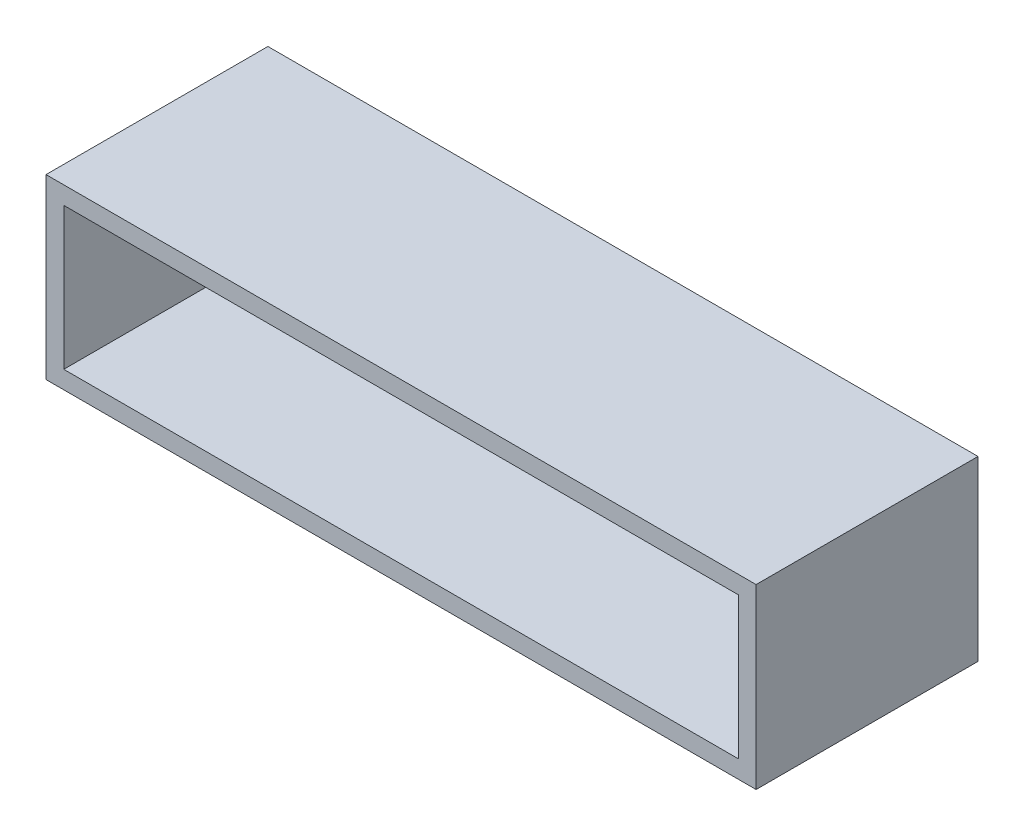
ISO-10303-21;
HEADER;
FILE_DESCRIPTION(('STEP AP214'),'2;1');
FILE_NAME('part.step','',(''),(''),'','','');
FILE_SCHEMA(('AUTOMOTIVE_DESIGN { 1 0 10303 214 1 1 1 1 }'));
ENDSEC;
DATA;
#1=APPLICATION_CONTEXT('core data for automotive mechanical design processes');
#2=APPLICATION_PROTOCOL_DEFINITION('international standard','automotive_design',2000,#1);
#3=PRODUCT_CONTEXT('',#1,'mechanical');
#4=PRODUCT('Part','Part','',(#3));
#5=PRODUCT_RELATED_PRODUCT_CATEGORY('part','',(#4));
#6=PRODUCT_DEFINITION_FORMATION('','',#4);
#7=PRODUCT_DEFINITION_CONTEXT('part definition',#1,'design');
#8=PRODUCT_DEFINITION('design','',#6,#7);
#9=PRODUCT_DEFINITION_SHAPE('','',#8);
#10=(LENGTH_UNIT() NAMED_UNIT(*) SI_UNIT(.MILLI.,.METRE.));
#11=(NAMED_UNIT(*) PLANE_ANGLE_UNIT() SI_UNIT($,.RADIAN.));
#12=(NAMED_UNIT(*) SI_UNIT($,.STERADIAN.) SOLID_ANGLE_UNIT());
#13=UNCERTAINTY_MEASURE_WITH_UNIT(LENGTH_MEASURE(1.E-05),#10,'distance_accuracy_value','');
#14=(GEOMETRIC_REPRESENTATION_CONTEXT(3) GLOBAL_UNCERTAINTY_ASSIGNED_CONTEXT((#13)) GLOBAL_UNIT_ASSIGNED_CONTEXT((#10,
#11,#12)) REPRESENTATION_CONTEXT('',''));
#15=CARTESIAN_POINT('',(0.,0.,0.));
#16=DIRECTION('',(0.,0.,1.));
#17=DIRECTION('',(1.,0.,0.));
#18=AXIS2_PLACEMENT_3D('',#15,#16,#17);
#19=CARTESIAN_POINT('',(-44.1965984572754,20.,30.0782406167568));
#20=DIRECTION('',(1.,0.,0.));
#21=DIRECTION('',(0.,0.,-1.));
#22=AXIS2_PLACEMENT_3D('',#19,#20,#21);
#23=PLANE('',#22);
#24=DIRECTION('',(0.,0.,1.));
#25=VECTOR('',#24,1.);
#26=CARTESIAN_POINT('',(-44.1965984572754,0.,30.0782406167568));
#27=LINE('',#26,#25);
#28=CARTESIAN_POINT('',(-44.1965984572754,0.,5.07824061675684));
#29=VERTEX_POINT('',#28);
#30=CARTESIAN_POINT('',(-44.1965984572754,0.,30.0782406167568));
#31=VERTEX_POINT('',#30);
#32=EDGE_CURVE('E144',#29,#31,#27,.T.);
#33=ORIENTED_EDGE('',*,*,#32,.T.);
#34=DIRECTION('',(0.,-1.,0.));
#35=VECTOR('',#34,1.);
#36=CARTESIAN_POINT('',(-44.1965984572754,20.,30.0782406167568));
#37=LINE('',#36,#35);
#38=CARTESIAN_POINT('',(-44.1965984572754,20.,30.0782406167568));
#39=VERTEX_POINT('',#38);
#40=EDGE_CURVE('E11',#39,#31,#37,.T.);
#41=ORIENTED_EDGE('',*,*,#40,.F.);
#42=DIRECTION('',(0.,0.,1.));
#43=VECTOR('',#42,1.);
#44=CARTESIAN_POINT('',(-44.1965984572754,20.,30.0782406167568));
#45=LINE('',#44,#43);
#46=CARTESIAN_POINT('',(-44.1965984572754,20.,5.07824061675684));
#47=VERTEX_POINT('',#46);
#48=EDGE_CURVE('E148',#47,#39,#45,.T.);
#49=ORIENTED_EDGE('',*,*,#48,.F.);
#50=DIRECTION('',(0.,-1.,0.));
#51=VECTOR('',#50,1.);
#52=CARTESIAN_POINT('',(-44.1965984572754,20.,5.07824061675684));
#53=LINE('',#52,#51);
#54=EDGE_CURVE('E154',#47,#29,#53,.T.);
#55=ORIENTED_EDGE('',*,*,#54,.T.);
#56=EDGE_LOOP('',(#33,#41,#49,#55));
#57=FACE_BOUND('',#56,.T.);
#58=ADVANCED_FACE('F33',(#57),#23,.F.);
#59=CARTESIAN_POINT('',(-44.1965984572754,20.,30.0782406167568));
#60=DIRECTION('',(0.,0.,-1.));
#61=DIRECTION('',(-1.,0.,0.));
#62=AXIS2_PLACEMENT_3D('',#59,#60,#61);
#63=PLANE('',#62);
#64=DIRECTION('',(1.,0.,0.));
#65=VECTOR('',#64,1.);
#66=CARTESIAN_POINT('',(-42.1965984572754,2.,30.0782406167568));
#67=LINE('',#66,#65);
#68=CARTESIAN_POINT('',(-42.1965984572754,2.,30.0782406167568));
#69=VERTEX_POINT('',#68);
#70=CARTESIAN_POINT('',(33.8034015427246,2.,30.0782406167568));
#71=VERTEX_POINT('',#70);
#72=EDGE_CURVE('E138',#69,#71,#67,.T.);
#73=ORIENTED_EDGE('',*,*,#72,.F.);
#74=DIRECTION('',(0.,-1.,0.));
#75=VECTOR('',#74,1.);
#76=CARTESIAN_POINT('',(-42.1965984572754,18.,30.0782406167568));
#77=LINE('',#76,#75);
#78=CARTESIAN_POINT('',(-42.1965984572754,18.,30.0782406167568));
#79=VERTEX_POINT('',#78);
#80=EDGE_CURVE('E47',#79,#69,#77,.T.);
#81=ORIENTED_EDGE('',*,*,#80,.F.);
#82=DIRECTION('',(-1.,0.,0.));
#83=VECTOR('',#82,1.);
#84=CARTESIAN_POINT('',(-42.1965984572754,18.,30.0782406167568));
#85=LINE('',#84,#83);
#86=CARTESIAN_POINT('',(33.8034015427246,18.,30.0782406167568));
#87=VERTEX_POINT('',#86);
#88=EDGE_CURVE('E126',#87,#79,#85,.T.);
#89=ORIENTED_EDGE('',*,*,#88,.F.);
#90=DIRECTION('',(0.,1.,0.));
#91=VECTOR('',#90,1.);
#92=CARTESIAN_POINT('',(33.8034015427246,18.,30.0782406167568));
#93=LINE('',#92,#91);
#94=EDGE_CURVE('E129',#71,#87,#93,.T.);
#95=ORIENTED_EDGE('',*,*,#94,.F.);
#96=EDGE_LOOP('',(#73,#81,#89,#95));
#97=FACE_BOUND('',#96,.T.);
#98=DIRECTION('',(1.,0.,0.));
#99=VECTOR('',#98,1.);
#100=CARTESIAN_POINT('',(-44.1965984572754,0.,30.0782406167568));
#101=LINE('',#100,#99);
#102=CARTESIAN_POINT('',(35.8034015427246,0.,30.0782406167568));
#103=VERTEX_POINT('',#102);
#104=EDGE_CURVE('E157',#31,#103,#101,.T.);
#105=ORIENTED_EDGE('',*,*,#104,.T.);
#106=DIRECTION('',(0.,-1.,0.));
#107=VECTOR('',#106,1.);
#108=CARTESIAN_POINT('',(35.8034015427246,20.,30.0782406167568));
#109=LINE('',#108,#107);
#110=CARTESIAN_POINT('',(35.8034015427246,20.,30.0782406167568));
#111=VERTEX_POINT('',#110);
#112=EDGE_CURVE('E40',#111,#103,#109,.T.);
#113=ORIENTED_EDGE('',*,*,#112,.F.);
#114=DIRECTION('',(1.,0.,0.));
#115=VECTOR('',#114,1.);
#116=CARTESIAN_POINT('',(-44.1965984572754,20.,30.0782406167568));
#117=LINE('',#116,#115);
#118=EDGE_CURVE('E84',#39,#111,#117,.T.);
#119=ORIENTED_EDGE('',*,*,#118,.F.);
#120=ORIENTED_EDGE('',*,*,#40,.T.);
#121=EDGE_LOOP('',(#105,#113,#119,#120));
#122=FACE_BOUND('',#121,.T.);
#123=ADVANCED_FACE('F188',(#97,#122),#63,.F.);
#124=CARTESIAN_POINT('',(35.8034015427246,20.,30.0782406167568));
#125=DIRECTION('',(-1.,0.,0.));
#126=DIRECTION('',(0.,0.,1.));
#127=AXIS2_PLACEMENT_3D('',#124,#125,#126);
#128=PLANE('',#127);
#129=DIRECTION('',(0.,0.,-1.));
#130=VECTOR('',#129,1.);
#131=CARTESIAN_POINT('',(35.8034015427246,0.,30.0782406167568));
#132=LINE('',#131,#130);
#133=CARTESIAN_POINT('',(35.8034015427246,0.,5.07824061675684));
#134=VERTEX_POINT('',#133);
#135=EDGE_CURVE('E159',#103,#134,#132,.T.);
#136=ORIENTED_EDGE('',*,*,#135,.T.);
#137=DIRECTION('',(0.,-1.,0.));
#138=VECTOR('',#137,1.);
#139=CARTESIAN_POINT('',(35.8034015427246,20.,5.07824061675684));
#140=LINE('',#139,#138);
#141=CARTESIAN_POINT('',(35.8034015427246,20.,5.07824061675684));
#142=VERTEX_POINT('',#141);
#143=EDGE_CURVE('E163',#142,#134,#140,.T.);
#144=ORIENTED_EDGE('',*,*,#143,.F.);
#145=DIRECTION('',(0.,0.,-1.));
#146=VECTOR('',#145,1.);
#147=CARTESIAN_POINT('',(35.8034015427246,20.,30.0782406167568));
#148=LINE('',#147,#146);
#149=EDGE_CURVE('E151',#111,#142,#148,.T.);
#150=ORIENTED_EDGE('',*,*,#149,.F.);
#151=ORIENTED_EDGE('',*,*,#112,.T.);
#152=EDGE_LOOP('',(#136,#144,#150,#151));
#153=FACE_BOUND('',#152,.T.);
#154=ADVANCED_FACE('F168',(#153),#128,.F.);
#155=CARTESIAN_POINT('',(-44.1965984572754,20.,5.07824061675684));
#156=DIRECTION('',(0.,0.,1.));
#157=DIRECTION('',(1.,0.,0.));
#158=AXIS2_PLACEMENT_3D('',#155,#156,#157);
#159=PLANE('',#158);
#160=CARTESIAN_POINT('',(23.3034015427246,10.,5.07824061675684));
#161=DIRECTION('',(0.,0.,1.));
#162=DIRECTION('',(1.,0.,0.));
#163=AXIS2_PLACEMENT_3D('',#160,#161,#162);
#164=CIRCLE('',#163,2.5);
#165=CARTESIAN_POINT('',(25.8034015427246,10.,5.07824061675684));
#166=VERTEX_POINT('',#165);
#167=EDGE_CURVE('E294',#166,#166,#164,.T.);
#168=ORIENTED_EDGE('',*,*,#167,.T.);
#169=EDGE_LOOP('',(#168));
#170=FACE_BOUND('',#169,.T.);
#171=CARTESIAN_POINT('',(-31.6965984572754,9.99999999999999,5.07824061675684));
#172=DIRECTION('',(0.,0.,1.));
#173=DIRECTION('',(1.,0.,0.));
#174=AXIS2_PLACEMENT_3D('',#171,#172,#173);
#175=CIRCLE('',#174,2.5);
#176=CARTESIAN_POINT('',(-29.1965984572754,9.99999999999999,5.07824061675684));
#177=VERTEX_POINT('',#176);
#178=EDGE_CURVE('E298',#177,#177,#175,.T.);
#179=ORIENTED_EDGE('',*,*,#178,.T.);
#180=EDGE_LOOP('',(#179));
#181=FACE_BOUND('',#180,.T.);
#182=CARTESIAN_POINT('',(-39.1965984572754,10.,5.07824061675684));
#183=DIRECTION('',(0.,0.,1.));
#184=DIRECTION('',(1.,0.,0.));
#185=AXIS2_PLACEMENT_3D('',#182,#183,#184);
#186=CIRCLE('',#185,0.999999999999998);
#187=CARTESIAN_POINT('',(-38.1965984572754,10.,5.07824061675684));
#188=VERTEX_POINT('',#187);
#189=EDGE_CURVE('E307',#188,#188,#186,.T.);
#190=ORIENTED_EDGE('',*,*,#189,.T.);
#191=EDGE_LOOP('',(#190));
#192=FACE_BOUND('',#191,.T.);
#193=CARTESIAN_POINT('',(30.8034015427246,10.,5.07824061675684));
#194=DIRECTION('',(0.,0.,1.));
#195=DIRECTION('',(1.,0.,0.));
#196=AXIS2_PLACEMENT_3D('',#193,#194,#195);
#197=CIRCLE('',#196,0.999999999999994);
#198=CARTESIAN_POINT('',(31.8034015427246,10.,5.07824061675684));
#199=VERTEX_POINT('',#198);
#200=EDGE_CURVE('E132',#199,#199,#197,.T.);
#201=ORIENTED_EDGE('',*,*,#200,.T.);
#202=EDGE_LOOP('',(#201));
#203=FACE_BOUND('',#202,.T.);
#204=DIRECTION('',(-1.,0.,0.));
#205=VECTOR('',#204,1.);
#206=CARTESIAN_POINT('',(-44.1965984572754,0.,5.07824061675684));
#207=LINE('',#206,#205);
#208=EDGE_CURVE('E77',#134,#29,#207,.T.);
#209=ORIENTED_EDGE('',*,*,#208,.T.);
#210=ORIENTED_EDGE('',*,*,#54,.F.);
#211=DIRECTION('',(-1.,0.,0.));
#212=VECTOR('',#211,1.);
#213=CARTESIAN_POINT('',(-44.1965984572754,20.,5.07824061675684));
#214=LINE('',#213,#212);
#215=EDGE_CURVE('E56',#142,#47,#214,.T.);
#216=ORIENTED_EDGE('',*,*,#215,.F.);
#217=ORIENTED_EDGE('',*,*,#143,.T.);
#218=EDGE_LOOP('',(#209,#210,#216,#217));
#219=FACE_BOUND('',#218,.T.);
#220=ADVANCED_FACE('F176',(#170,#181,#192,#203,#219),#159,.F.);
#221=CARTESIAN_POINT('',(0.,20.,0.));
#222=DIRECTION('',(0.,-1.,0.));
#223=DIRECTION('',(0.,0.,-1.));
#224=AXIS2_PLACEMENT_3D('',#221,#222,#223);
#225=PLANE('',#224);
#226=ORIENTED_EDGE('',*,*,#48,.T.);
#227=ORIENTED_EDGE('',*,*,#118,.T.);
#228=ORIENTED_EDGE('',*,*,#149,.T.);
#229=ORIENTED_EDGE('',*,*,#215,.T.);
#230=EDGE_LOOP('',(#226,#227,#228,#229));
#231=FACE_BOUND('',#230,.T.);
#232=ADVANCED_FACE('F178',(#231),#225,.F.);
#233=CARTESIAN_POINT('',(0.,0.,0.));
#234=DIRECTION('',(0.,-1.,0.));
#235=DIRECTION('',(0.,0.,-1.));
#236=AXIS2_PLACEMENT_3D('',#233,#234,#235);
#237=PLANE('',#236);
#238=ORIENTED_EDGE('',*,*,#32,.F.);
#239=ORIENTED_EDGE('',*,*,#208,.F.);
#240=ORIENTED_EDGE('',*,*,#135,.F.);
#241=ORIENTED_EDGE('',*,*,#104,.F.);
#242=EDGE_LOOP('',(#238,#239,#240,#241));
#243=FACE_BOUND('',#242,.T.);
#244=ADVANCED_FACE('F172',(#243),#237,.T.);
#245=CARTESIAN_POINT('',(-42.1965984572754,18.,7.07824061675685));
#246=DIRECTION('',(-1.,0.,0.));
#247=DIRECTION('',(0.,0.,1.));
#248=AXIS2_PLACEMENT_3D('',#245,#246,#247);
#249=PLANE('',#248);
#250=ORIENTED_EDGE('',*,*,#80,.T.);
#251=DIRECTION('',(0.,0.,1.));
#252=VECTOR('',#251,1.);
#253=CARTESIAN_POINT('',(-42.1965984572754,2.,7.07824061675685));
#254=LINE('',#253,#252);
#255=CARTESIAN_POINT('',(-42.1965984572754,2.,7.07824061675685));
#256=VERTEX_POINT('',#255);
#257=EDGE_CURVE('E104',#256,#69,#254,.T.);
#258=ORIENTED_EDGE('',*,*,#257,.F.);
#259=DIRECTION('',(0.,-1.,0.));
#260=VECTOR('',#259,1.);
#261=CARTESIAN_POINT('',(-42.1965984572754,18.,7.07824061675685));
#262=LINE('',#261,#260);
#263=CARTESIAN_POINT('',(-42.1965984572754,18.,7.07824061675685));
#264=VERTEX_POINT('',#263);
#265=EDGE_CURVE('E108',#264,#256,#262,.T.);
#266=ORIENTED_EDGE('',*,*,#265,.F.);
#267=DIRECTION('',(0.,0.,1.));
#268=VECTOR('',#267,1.);
#269=CARTESIAN_POINT('',(-42.1965984572754,18.,7.07824061675685));
#270=LINE('',#269,#268);
#271=EDGE_CURVE('E142',#264,#79,#270,.T.);
#272=ORIENTED_EDGE('',*,*,#271,.T.);
#273=EDGE_LOOP('',(#250,#258,#266,#272));
#274=FACE_BOUND('',#273,.T.);
#275=ADVANCED_FACE('F106',(#274),#249,.F.);
#276=CARTESIAN_POINT('',(-42.1965984572754,18.,7.07824061675685));
#277=DIRECTION('',(0.,1.,0.));
#278=DIRECTION('',(0.,0.,1.));
#279=AXIS2_PLACEMENT_3D('',#276,#277,#278);
#280=PLANE('',#279);
#281=ORIENTED_EDGE('',*,*,#88,.T.);
#282=ORIENTED_EDGE('',*,*,#271,.F.);
#283=DIRECTION('',(-1.,0.,0.));
#284=VECTOR('',#283,1.);
#285=CARTESIAN_POINT('',(-42.1965984572754,18.,7.07824061675685));
#286=LINE('',#285,#284);
#287=CARTESIAN_POINT('',(33.8034015427246,18.,7.07824061675685));
#288=VERTEX_POINT('',#287);
#289=EDGE_CURVE('E114',#288,#264,#286,.T.);
#290=ORIENTED_EDGE('',*,*,#289,.F.);
#291=DIRECTION('',(0.,0.,1.));
#292=VECTOR('',#291,1.);
#293=CARTESIAN_POINT('',(33.8034015427246,18.,7.07824061675685));
#294=LINE('',#293,#292);
#295=EDGE_CURVE('E145',#288,#87,#294,.T.);
#296=ORIENTED_EDGE('',*,*,#295,.T.);
#297=EDGE_LOOP('',(#281,#282,#290,#296));
#298=FACE_BOUND('',#297,.T.);
#299=ADVANCED_FACE('F205',(#298),#280,.F.);
#300=CARTESIAN_POINT('',(33.8034015427246,18.,7.07824061675685));
#301=DIRECTION('',(1.,0.,0.));
#302=DIRECTION('',(0.,0.,-1.));
#303=AXIS2_PLACEMENT_3D('',#300,#301,#302);
#304=PLANE('',#303);
#305=ORIENTED_EDGE('',*,*,#94,.T.);
#306=ORIENTED_EDGE('',*,*,#295,.F.);
#307=DIRECTION('',(0.,1.,0.));
#308=VECTOR('',#307,1.);
#309=CARTESIAN_POINT('',(33.8034015427246,18.,7.07824061675685));
#310=LINE('',#309,#308);
#311=CARTESIAN_POINT('',(33.8034015427246,2.,7.07824061675685));
#312=VERTEX_POINT('',#311);
#313=EDGE_CURVE('E122',#312,#288,#310,.T.);
#314=ORIENTED_EDGE('',*,*,#313,.F.);
#315=DIRECTION('',(0.,0.,1.));
#316=VECTOR('',#315,1.);
#317=CARTESIAN_POINT('',(33.8034015427246,2.,7.07824061675685));
#318=LINE('',#317,#316);
#319=EDGE_CURVE('E113',#312,#71,#318,.T.);
#320=ORIENTED_EDGE('',*,*,#319,.T.);
#321=EDGE_LOOP('',(#305,#306,#314,#320));
#322=FACE_BOUND('',#321,.T.);
#323=ADVANCED_FACE('F203',(#322),#304,.F.);
#324=CARTESIAN_POINT('',(-42.1965984572754,2.,7.07824061675685));
#325=DIRECTION('',(0.,-1.,0.));
#326=DIRECTION('',(0.,0.,-1.));
#327=AXIS2_PLACEMENT_3D('',#324,#325,#326);
#328=PLANE('',#327);
#329=ORIENTED_EDGE('',*,*,#72,.T.);
#330=ORIENTED_EDGE('',*,*,#319,.F.);
#331=DIRECTION('',(1.,0.,0.));
#332=VECTOR('',#331,1.);
#333=CARTESIAN_POINT('',(-42.1965984572754,2.,7.07824061675685));
#334=LINE('',#333,#332);
#335=EDGE_CURVE('E117',#256,#312,#334,.T.);
#336=ORIENTED_EDGE('',*,*,#335,.F.);
#337=ORIENTED_EDGE('',*,*,#257,.T.);
#338=EDGE_LOOP('',(#329,#330,#336,#337));
#339=FACE_BOUND('',#338,.T.);
#340=ADVANCED_FACE('F118',(#339),#328,.F.);
#341=CARTESIAN_POINT('',(0.,0.,7.07824061675685));
#342=DIRECTION('',(0.,0.,1.));
#343=DIRECTION('',(1.,0.,0.));
#344=AXIS2_PLACEMENT_3D('',#341,#342,#343);
#345=PLANE('',#344);
#346=CARTESIAN_POINT('',(23.3034015427246,10.,7.07824061675685));
#347=DIRECTION('',(0.,0.,1.));
#348=DIRECTION('',(1.,0.,0.));
#349=AXIS2_PLACEMENT_3D('',#346,#347,#348);
#350=CIRCLE('',#349,2.5);
#351=CARTESIAN_POINT('',(25.8034015427246,10.,7.07824061675685));
#352=VERTEX_POINT('',#351);
#353=EDGE_CURVE('E292',#352,#352,#350,.T.);
#354=ORIENTED_EDGE('',*,*,#353,.F.);
#355=EDGE_LOOP('',(#354));
#356=FACE_BOUND('',#355,.T.);
#357=CARTESIAN_POINT('',(-31.6965984572754,9.99999999999999,7.07824061675685));
#358=DIRECTION('',(0.,0.,1.));
#359=DIRECTION('',(1.,0.,0.));
#360=AXIS2_PLACEMENT_3D('',#357,#358,#359);
#361=CIRCLE('',#360,2.5);
#362=CARTESIAN_POINT('',(-29.1965984572754,9.99999999999999,7.07824061675685));
#363=VERTEX_POINT('',#362);
#364=EDGE_CURVE('E295',#363,#363,#361,.T.);
#365=ORIENTED_EDGE('',*,*,#364,.F.);
#366=EDGE_LOOP('',(#365));
#367=FACE_BOUND('',#366,.T.);
#368=CARTESIAN_POINT('',(-39.1965984572754,10.,7.07824061675685));
#369=DIRECTION('',(0.,0.,1.));
#370=DIRECTION('',(1.,0.,0.));
#371=AXIS2_PLACEMENT_3D('',#368,#369,#370);
#372=CIRCLE('',#371,0.999999999999998);
#373=CARTESIAN_POINT('',(-38.1965984572754,10.,7.07824061675685));
#374=VERTEX_POINT('',#373);
#375=EDGE_CURVE('E304',#374,#374,#372,.T.);
#376=ORIENTED_EDGE('',*,*,#375,.F.);
#377=EDGE_LOOP('',(#376));
#378=FACE_BOUND('',#377,.T.);
#379=CARTESIAN_POINT('',(30.8034015427246,10.,7.07824061675685));
#380=DIRECTION('',(0.,0.,1.));
#381=DIRECTION('',(1.,0.,0.));
#382=AXIS2_PLACEMENT_3D('',#379,#380,#381);
#383=CIRCLE('',#382,0.999999999999994);
#384=CARTESIAN_POINT('',(31.8034015427246,10.,7.07824061675685));
#385=VERTEX_POINT('',#384);
#386=EDGE_CURVE('E309',#385,#385,#383,.T.);
#387=ORIENTED_EDGE('',*,*,#386,.F.);
#388=EDGE_LOOP('',(#387));
#389=FACE_BOUND('',#388,.T.);
#390=ORIENTED_EDGE('',*,*,#265,.T.);
#391=ORIENTED_EDGE('',*,*,#335,.T.);
#392=ORIENTED_EDGE('',*,*,#313,.T.);
#393=ORIENTED_EDGE('',*,*,#289,.T.);
#394=EDGE_LOOP('',(#390,#391,#392,#393));
#395=FACE_BOUND('',#394,.T.);
#396=ADVANCED_FACE('F124',(#356,#367,#378,#389,#395),#345,.T.);
#397=CARTESIAN_POINT('',(30.8034015427246,10.,-40.9217593832432));
#398=DIRECTION('',(0.,0.,1.));
#399=DIRECTION('',(1.,0.,0.));
#400=AXIS2_PLACEMENT_3D('',#397,#398,#399);
#401=CYLINDRICAL_SURFACE('',#400,0.999999999999994);
#402=ORIENTED_EDGE('',*,*,#386,.T.);
#403=EDGE_LOOP('',(#402));
#404=FACE_BOUND('',#403,.T.);
#405=ORIENTED_EDGE('',*,*,#200,.F.);
#406=EDGE_LOOP('',(#405));
#407=FACE_BOUND('',#406,.T.);
#408=ADVANCED_FACE('F252',(#404,#407),#401,.F.);
#409=CARTESIAN_POINT('',(-39.1965984572754,10.,-40.9217593832432));
#410=DIRECTION('',(0.,0.,1.));
#411=DIRECTION('',(1.,0.,0.));
#412=AXIS2_PLACEMENT_3D('',#409,#410,#411);
#413=CYLINDRICAL_SURFACE('',#412,0.999999999999998);
#414=ORIENTED_EDGE('',*,*,#375,.T.);
#415=EDGE_LOOP('',(#414));
#416=FACE_BOUND('',#415,.T.);
#417=ORIENTED_EDGE('',*,*,#189,.F.);
#418=EDGE_LOOP('',(#417));
#419=FACE_BOUND('',#418,.T.);
#420=ADVANCED_FACE('F256',(#416,#419),#413,.F.);
#421=CARTESIAN_POINT('',(-31.6965984572754,9.99999999999999,-40.9217593832432));
#422=DIRECTION('',(0.,0.,1.));
#423=DIRECTION('',(1.,0.,0.));
#424=AXIS2_PLACEMENT_3D('',#421,#422,#423);
#425=CYLINDRICAL_SURFACE('',#424,2.5);
#426=ORIENTED_EDGE('',*,*,#364,.T.);
#427=EDGE_LOOP('',(#426));
#428=FACE_BOUND('',#427,.T.);
#429=ORIENTED_EDGE('',*,*,#178,.F.);
#430=EDGE_LOOP('',(#429));
#431=FACE_BOUND('',#430,.T.);
#432=ADVANCED_FACE('F264',(#428,#431),#425,.F.);
#433=CARTESIAN_POINT('',(23.3034015427246,10.,-40.9217593832432));
#434=DIRECTION('',(0.,0.,1.));
#435=DIRECTION('',(1.,0.,0.));
#436=AXIS2_PLACEMENT_3D('',#433,#434,#435);
#437=CYLINDRICAL_SURFACE('',#436,2.5);
#438=ORIENTED_EDGE('',*,*,#353,.T.);
#439=EDGE_LOOP('',(#438));
#440=FACE_BOUND('',#439,.T.);
#441=ORIENTED_EDGE('',*,*,#167,.F.);
#442=EDGE_LOOP('',(#441));
#443=FACE_BOUND('',#442,.T.);
#444=ADVANCED_FACE('F275',(#440,#443),#437,.F.);
#445=CLOSED_SHELL('',(#58,#123,#154,#220,#232,#244,#275,#299,#323,#340,#396,#408,#420,#432,#444));
#446=MANIFOLD_SOLID_BREP('B2',#445);
#447=ADVANCED_BREP_SHAPE_REPRESENTATION('',(#18,#446),#14);
#448=SHAPE_DEFINITION_REPRESENTATION(#9,#447);
ENDSEC;
END-ISO-10303-21;
